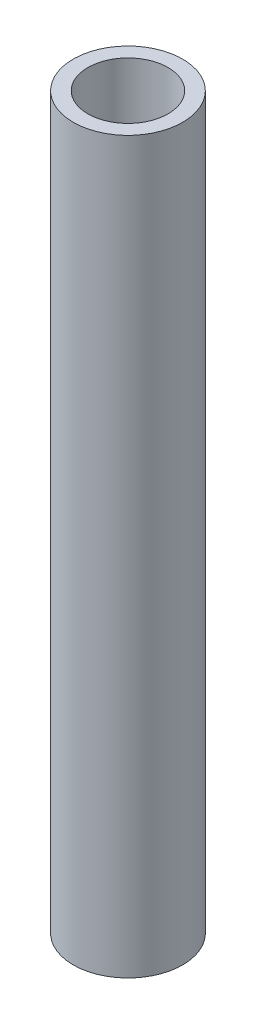
ISO-10303-21;
HEADER;
FILE_DESCRIPTION(('STEP AP214'),'2;1');
FILE_NAME('part.step','',(''),(''),'','','');
FILE_SCHEMA(('AUTOMOTIVE_DESIGN { 1 0 10303 214 1 1 1 1 }'));
ENDSEC;
DATA;
#1=APPLICATION_CONTEXT('core data for automotive mechanical design processes');
#2=APPLICATION_PROTOCOL_DEFINITION('international standard','automotive_design',2000,#1);
#3=PRODUCT_CONTEXT('',#1,'mechanical');
#4=PRODUCT('Part','Part','',(#3));
#5=PRODUCT_RELATED_PRODUCT_CATEGORY('part','',(#4));
#6=PRODUCT_DEFINITION_FORMATION('','',#4);
#7=PRODUCT_DEFINITION_CONTEXT('part definition',#1,'design');
#8=PRODUCT_DEFINITION('design','',#6,#7);
#9=PRODUCT_DEFINITION_SHAPE('','',#8);
#10=(LENGTH_UNIT() NAMED_UNIT(*) SI_UNIT(.MILLI.,.METRE.));
#11=(NAMED_UNIT(*) PLANE_ANGLE_UNIT() SI_UNIT($,.RADIAN.));
#12=(NAMED_UNIT(*) SI_UNIT($,.STERADIAN.) SOLID_ANGLE_UNIT());
#13=UNCERTAINTY_MEASURE_WITH_UNIT(LENGTH_MEASURE(1.E-05),#10,'distance_accuracy_value','');
#14=(GEOMETRIC_REPRESENTATION_CONTEXT(3) GLOBAL_UNCERTAINTY_ASSIGNED_CONTEXT((#13)) GLOBAL_UNIT_ASSIGNED_CONTEXT((#10,
#11,#12)) REPRESENTATION_CONTEXT('',''));
#15=CARTESIAN_POINT('',(0.,0.,0.));
#16=DIRECTION('',(0.,0.,1.));
#17=DIRECTION('',(1.,0.,0.));
#18=AXIS2_PLACEMENT_3D('',#15,#16,#17);
#19=CARTESIAN_POINT('',(0.,20.,0.));
#20=DIRECTION('',(0.,1.,0.));
#21=DIRECTION('',(0.,0.,1.));
#22=AXIS2_PLACEMENT_3D('',#19,#20,#21);
#23=PLANE('',#22);
#24=CARTESIAN_POINT('',(0.,20.,0.));
#25=DIRECTION('',(0.,1.,0.));
#26=DIRECTION('',(0.,0.,1.));
#27=AXIS2_PLACEMENT_3D('',#24,#25,#26);
#28=CIRCLE('',#27,1.5);
#29=CARTESIAN_POINT('',(0.,20.,1.5));
#30=VERTEX_POINT('',#29);
#31=EDGE_CURVE('E10',#30,#30,#28,.T.);
#32=ORIENTED_EDGE('',*,*,#31,.T.);
#33=EDGE_LOOP('',(#32));
#34=FACE_BOUND('',#33,.T.);
#35=CARTESIAN_POINT('',(0.,20.,0.));
#36=DIRECTION('',(0.,1.,0.));
#37=DIRECTION('',(0.,0.,1.));
#38=AXIS2_PLACEMENT_3D('',#35,#36,#37);
#39=CIRCLE('',#38,1.1);
#40=CARTESIAN_POINT('',(0.,20.,1.1));
#41=VERTEX_POINT('',#40);
#42=EDGE_CURVE('E39',#41,#41,#39,.T.);
#43=ORIENTED_EDGE('',*,*,#42,.F.);
#44=EDGE_LOOP('',(#43));
#45=FACE_BOUND('',#44,.T.);
#46=ADVANCED_FACE('F28',(#34,#45),#23,.T.);
#47=CARTESIAN_POINT('',(0.,0.,0.));
#48=DIRECTION('',(0.,1.,0.));
#49=DIRECTION('',(0.,0.,1.));
#50=AXIS2_PLACEMENT_3D('',#47,#48,#49);
#51=PLANE('',#50);
#52=CARTESIAN_POINT('',(0.,0.,0.));
#53=DIRECTION('',(0.,1.,0.));
#54=DIRECTION('',(0.,0.,1.));
#55=AXIS2_PLACEMENT_3D('',#52,#53,#54);
#56=CIRCLE('',#55,1.5);
#57=CARTESIAN_POINT('',(0.,0.,1.5));
#58=VERTEX_POINT('',#57);
#59=EDGE_CURVE('E35',#58,#58,#56,.T.);
#60=ORIENTED_EDGE('',*,*,#59,.F.);
#61=EDGE_LOOP('',(#60));
#62=FACE_BOUND('',#61,.T.);
#63=CARTESIAN_POINT('',(0.,0.,0.));
#64=DIRECTION('',(0.,1.,0.));
#65=DIRECTION('',(0.,0.,1.));
#66=AXIS2_PLACEMENT_3D('',#63,#64,#65);
#67=CIRCLE('',#66,1.1);
#68=CARTESIAN_POINT('',(0.,0.,1.1));
#69=VERTEX_POINT('',#68);
#70=EDGE_CURVE('E43',#69,#69,#67,.T.);
#71=ORIENTED_EDGE('',*,*,#70,.T.);
#72=EDGE_LOOP('',(#71));
#73=FACE_BOUND('',#72,.T.);
#74=ADVANCED_FACE('F49',(#62,#73),#51,.F.);
#75=CARTESIAN_POINT('',(0.,20.,0.));
#76=DIRECTION('',(0.,-1.,0.));
#77=DIRECTION('',(0.,0.,-1.));
#78=AXIS2_PLACEMENT_3D('',#75,#76,#77);
#79=CYLINDRICAL_SURFACE('',#78,1.5);
#80=ORIENTED_EDGE('',*,*,#31,.F.);
#81=EDGE_LOOP('',(#80));
#82=FACE_BOUND('',#81,.T.);
#83=ORIENTED_EDGE('',*,*,#59,.T.);
#84=EDGE_LOOP('',(#83));
#85=FACE_BOUND('',#84,.T.);
#86=ADVANCED_FACE('F30',(#82,#85),#79,.T.);
#87=CARTESIAN_POINT('',(0.,20.,0.));
#88=DIRECTION('',(0.,-1.,0.));
#89=DIRECTION('',(0.,0.,-1.));
#90=AXIS2_PLACEMENT_3D('',#87,#88,#89);
#91=CYLINDRICAL_SURFACE('',#90,1.1);
#92=ORIENTED_EDGE('',*,*,#42,.T.);
#93=EDGE_LOOP('',(#92));
#94=FACE_BOUND('',#93,.T.);
#95=ORIENTED_EDGE('',*,*,#70,.F.);
#96=EDGE_LOOP('',(#95));
#97=FACE_BOUND('',#96,.T.);
#98=ADVANCED_FACE('F51',(#94,#97),#91,.F.);
#99=CLOSED_SHELL('',(#46,#74,#86,#98));
#100=MANIFOLD_SOLID_BREP('B2',#99);
#101=ADVANCED_BREP_SHAPE_REPRESENTATION('',(#18,#100),#14);
#102=SHAPE_DEFINITION_REPRESENTATION(#9,#101);
ENDSEC;
END-ISO-10303-21;
